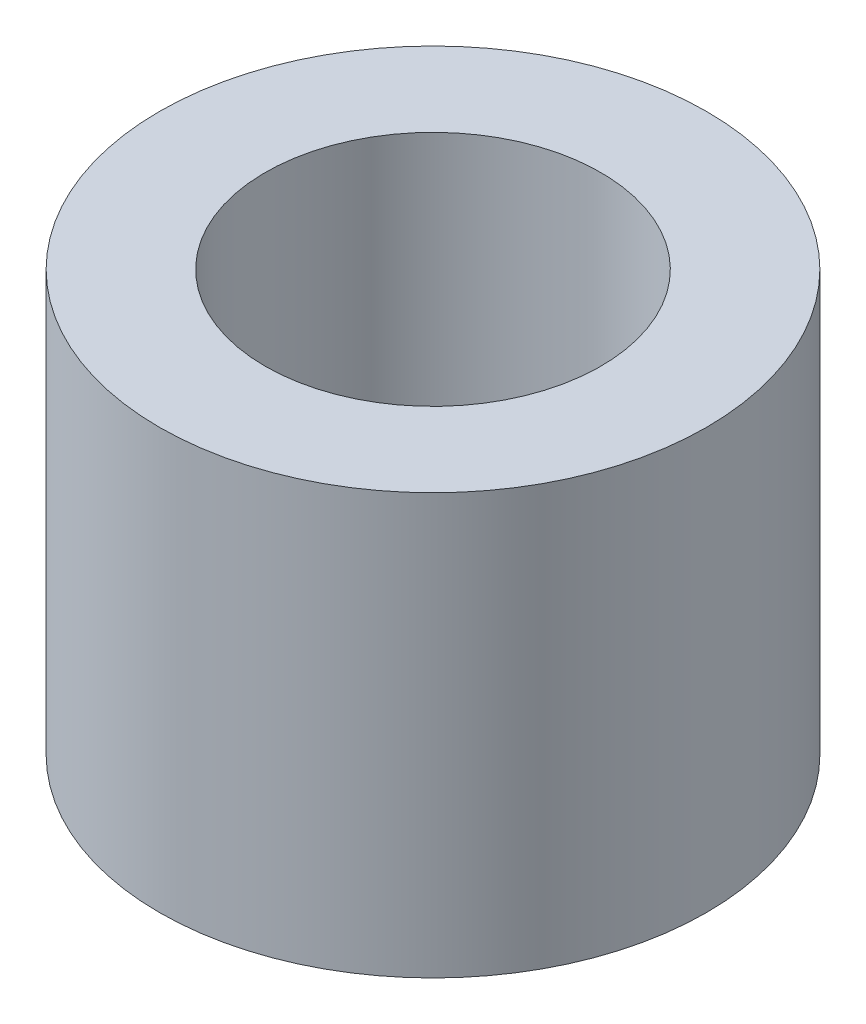
ISO-10303-21;
HEADER;
FILE_DESCRIPTION(('STEP AP214'),'2;1');
FILE_NAME('part.step','',(''),(''),'','','');
FILE_SCHEMA(('AUTOMOTIVE_DESIGN { 1 0 10303 214 1 1 1 1 }'));
ENDSEC;
DATA;
#1=APPLICATION_CONTEXT('core data for automotive mechanical design processes');
#2=APPLICATION_PROTOCOL_DEFINITION('international standard','automotive_design',2000,#1);
#3=PRODUCT_CONTEXT('',#1,'mechanical');
#4=PRODUCT('Part','Part','',(#3));
#5=PRODUCT_RELATED_PRODUCT_CATEGORY('part','',(#4));
#6=PRODUCT_DEFINITION_FORMATION('','',#4);
#7=PRODUCT_DEFINITION_CONTEXT('part definition',#1,'design');
#8=PRODUCT_DEFINITION('design','',#6,#7);
#9=PRODUCT_DEFINITION_SHAPE('','',#8);
#10=(LENGTH_UNIT() NAMED_UNIT(*) SI_UNIT(.MILLI.,.METRE.));
#11=(NAMED_UNIT(*) PLANE_ANGLE_UNIT() SI_UNIT($,.RADIAN.));
#12=(NAMED_UNIT(*) SI_UNIT($,.STERADIAN.) SOLID_ANGLE_UNIT());
#13=UNCERTAINTY_MEASURE_WITH_UNIT(LENGTH_MEASURE(1.E-05),#10,'distance_accuracy_value','');
#14=(GEOMETRIC_REPRESENTATION_CONTEXT(3) GLOBAL_UNCERTAINTY_ASSIGNED_CONTEXT((#13)) GLOBAL_UNIT_ASSIGNED_CONTEXT((#10,
#11,#12)) REPRESENTATION_CONTEXT('',''));
#15=CARTESIAN_POINT('',(0.,0.,0.));
#16=DIRECTION('',(0.,0.,1.));
#17=DIRECTION('',(1.,0.,0.));
#18=AXIS2_PLACEMENT_3D('',#15,#16,#17);
#19=CARTESIAN_POINT('',(0.,7.9502,0.));
#20=DIRECTION('',(0.,1.,0.));
#21=DIRECTION('',(0.,0.,1.));
#22=AXIS2_PLACEMENT_3D('',#19,#20,#21);
#23=PLANE('',#22);
#24=CARTESIAN_POINT('',(0.,7.9502,0.));
#25=DIRECTION('',(0.,1.,0.));
#26=DIRECTION('',(0.,0.,1.));
#27=AXIS2_PLACEMENT_3D('',#24,#25,#26);
#28=CIRCLE('',#27,5.17525);
#29=CARTESIAN_POINT('',(0.,7.9502,5.17525));
#30=VERTEX_POINT('',#29);
#31=EDGE_CURVE('E10',#30,#30,#28,.T.);
#32=ORIENTED_EDGE('',*,*,#31,.T.);
#33=EDGE_LOOP('',(#32));
#34=FACE_BOUND('',#33,.T.);
#35=CARTESIAN_POINT('',(0.,7.9502,0.));
#36=DIRECTION('',(0.,1.,0.));
#37=DIRECTION('',(0.,0.,1.));
#38=AXIS2_PLACEMENT_3D('',#35,#36,#37);
#39=CIRCLE('',#38,3.175);
#40=CARTESIAN_POINT('',(0.,7.9502,3.175));
#41=VERTEX_POINT('',#40);
#42=EDGE_CURVE('E41',#41,#41,#39,.T.);
#43=ORIENTED_EDGE('',*,*,#42,.F.);
#44=EDGE_LOOP('',(#43));
#45=FACE_BOUND('',#44,.T.);
#46=ADVANCED_FACE('F30',(#34,#45),#23,.T.);
#47=CARTESIAN_POINT('',(0.,0.,0.));
#48=DIRECTION('',(0.,1.,0.));
#49=DIRECTION('',(0.,0.,1.));
#50=AXIS2_PLACEMENT_3D('',#47,#48,#49);
#51=PLANE('',#50);
#52=CARTESIAN_POINT('',(0.,0.,0.));
#53=DIRECTION('',(0.,1.,0.));
#54=DIRECTION('',(0.,0.,1.));
#55=AXIS2_PLACEMENT_3D('',#52,#53,#54);
#56=CIRCLE('',#55,5.17525);
#57=CARTESIAN_POINT('',(0.,0.,5.17525));
#58=VERTEX_POINT('',#57);
#59=EDGE_CURVE('E34',#58,#58,#56,.T.);
#60=ORIENTED_EDGE('',*,*,#59,.F.);
#61=EDGE_LOOP('',(#60));
#62=FACE_BOUND('',#61,.T.);
#63=CARTESIAN_POINT('',(0.,0.,0.));
#64=DIRECTION('',(0.,1.,0.));
#65=DIRECTION('',(0.,0.,1.));
#66=AXIS2_PLACEMENT_3D('',#63,#64,#65);
#67=CIRCLE('',#66,3.175);
#68=CARTESIAN_POINT('',(0.,0.,3.175));
#69=VERTEX_POINT('',#68);
#70=EDGE_CURVE('E43',#69,#69,#67,.T.);
#71=ORIENTED_EDGE('',*,*,#70,.T.);
#72=EDGE_LOOP('',(#71));
#73=FACE_BOUND('',#72,.T.);
#74=ADVANCED_FACE('F53',(#62,#73),#51,.F.);
#75=CARTESIAN_POINT('',(0.,7.9502,0.));
#76=DIRECTION('',(0.,-1.,0.));
#77=DIRECTION('',(0.,0.,-1.));
#78=AXIS2_PLACEMENT_3D('',#75,#76,#77);
#79=CYLINDRICAL_SURFACE('',#78,5.17525);
#80=ORIENTED_EDGE('',*,*,#31,.F.);
#81=EDGE_LOOP('',(#80));
#82=FACE_BOUND('',#81,.T.);
#83=ORIENTED_EDGE('',*,*,#59,.T.);
#84=EDGE_LOOP('',(#83));
#85=FACE_BOUND('',#84,.T.);
#86=ADVANCED_FACE('F32',(#82,#85),#79,.T.);
#87=CARTESIAN_POINT('',(0.,7.9502,0.));
#88=DIRECTION('',(0.,-1.,0.));
#89=DIRECTION('',(0.,0.,-1.));
#90=AXIS2_PLACEMENT_3D('',#87,#88,#89);
#91=CYLINDRICAL_SURFACE('',#90,3.175);
#92=ORIENTED_EDGE('',*,*,#42,.T.);
#93=EDGE_LOOP('',(#92));
#94=FACE_BOUND('',#93,.T.);
#95=ORIENTED_EDGE('',*,*,#70,.F.);
#96=EDGE_LOOP('',(#95));
#97=FACE_BOUND('',#96,.T.);
#98=ADVANCED_FACE('F49',(#94,#97),#91,.F.);
#99=CLOSED_SHELL('',(#46,#74,#86,#98));
#100=MANIFOLD_SOLID_BREP('B2',#99);
#101=ADVANCED_BREP_SHAPE_REPRESENTATION('',(#18,#100),#14);
#102=SHAPE_DEFINITION_REPRESENTATION(#9,#101);
ENDSEC;
END-ISO-10303-21;
